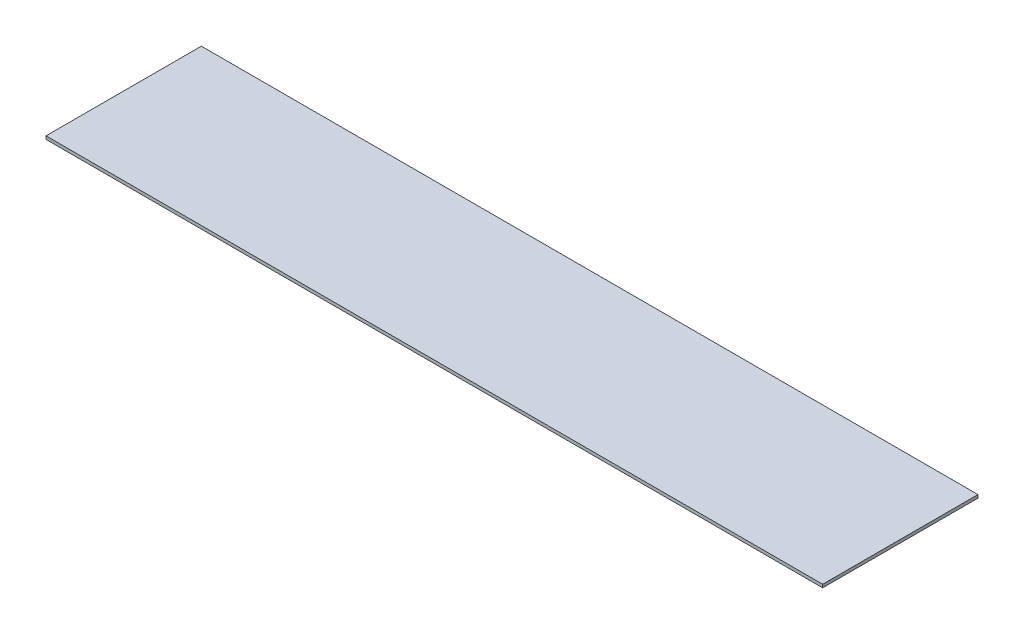
ISO-10303-21;
HEADER;
FILE_DESCRIPTION(('STEP AP214'),'2;1');
FILE_NAME('part.step','',(''),(''),'','','');
FILE_SCHEMA(('AUTOMOTIVE_DESIGN { 1 0 10303 214 1 1 1 1 }'));
ENDSEC;
DATA;
#1=APPLICATION_CONTEXT('core data for automotive mechanical design processes');
#2=APPLICATION_PROTOCOL_DEFINITION('international standard','automotive_design',2000,#1);
#3=PRODUCT_CONTEXT('',#1,'mechanical');
#4=PRODUCT('Part','Part','',(#3));
#5=PRODUCT_RELATED_PRODUCT_CATEGORY('part','',(#4));
#6=PRODUCT_DEFINITION_FORMATION('','',#4);
#7=PRODUCT_DEFINITION_CONTEXT('part definition',#1,'design');
#8=PRODUCT_DEFINITION('design','',#6,#7);
#9=PRODUCT_DEFINITION_SHAPE('','',#8);
#10=(LENGTH_UNIT() NAMED_UNIT(*) SI_UNIT(.MILLI.,.METRE.));
#11=(NAMED_UNIT(*) PLANE_ANGLE_UNIT() SI_UNIT($,.RADIAN.));
#12=(NAMED_UNIT(*) SI_UNIT($,.STERADIAN.) SOLID_ANGLE_UNIT());
#13=UNCERTAINTY_MEASURE_WITH_UNIT(LENGTH_MEASURE(1.E-05),#10,'distance_accuracy_value','');
#14=(GEOMETRIC_REPRESENTATION_CONTEXT(3) GLOBAL_UNCERTAINTY_ASSIGNED_CONTEXT((#13)) GLOBAL_UNIT_ASSIGNED_CONTEXT((#10,
#11,#12)) REPRESENTATION_CONTEXT('',''));
#15=CARTESIAN_POINT('',(0.,0.,0.));
#16=DIRECTION('',(0.,0.,1.));
#17=DIRECTION('',(1.,0.,0.));
#18=AXIS2_PLACEMENT_3D('',#15,#16,#17);
#19=CARTESIAN_POINT('',(25.,0.2,5.));
#20=DIRECTION('',(-1.,0.,0.));
#21=DIRECTION('',(0.,0.,1.));
#22=AXIS2_PLACEMENT_3D('',#19,#20,#21);
#23=PLANE('',#22);
#24=DIRECTION('',(0.,0.,-1.));
#25=VECTOR('',#24,1.);
#26=CARTESIAN_POINT('',(25.,0.,5.));
#27=LINE('',#26,#25);
#28=CARTESIAN_POINT('',(25.,0.,5.));
#29=VERTEX_POINT('',#28);
#30=CARTESIAN_POINT('',(25.,0.,-5.));
#31=VERTEX_POINT('',#30);
#32=EDGE_CURVE('E107',#29,#31,#27,.T.);
#33=ORIENTED_EDGE('',*,*,#32,.T.);
#34=DIRECTION('',(0.,-1.,0.));
#35=VECTOR('',#34,1.);
#36=CARTESIAN_POINT('',(25.,0.2,-5.));
#37=LINE('',#36,#35);
#38=CARTESIAN_POINT('',(25.,0.2,-5.));
#39=VERTEX_POINT('',#38);
#40=EDGE_CURVE('E11',#39,#31,#37,.T.);
#41=ORIENTED_EDGE('',*,*,#40,.F.);
#42=DIRECTION('',(0.,0.,-1.));
#43=VECTOR('',#42,1.);
#44=CARTESIAN_POINT('',(25.,0.2,5.));
#45=LINE('',#44,#43);
#46=CARTESIAN_POINT('',(25.,0.2,5.));
#47=VERTEX_POINT('',#46);
#48=EDGE_CURVE('E91',#47,#39,#45,.T.);
#49=ORIENTED_EDGE('',*,*,#48,.F.);
#50=DIRECTION('',(0.,-1.,0.));
#51=VECTOR('',#50,1.);
#52=CARTESIAN_POINT('',(25.,0.2,5.));
#53=LINE('',#52,#51);
#54=EDGE_CURVE('E103',#47,#29,#53,.T.);
#55=ORIENTED_EDGE('',*,*,#54,.T.);
#56=EDGE_LOOP('',(#33,#41,#49,#55));
#57=FACE_BOUND('',#56,.T.);
#58=ADVANCED_FACE('F39',(#57),#23,.F.);
#59=CARTESIAN_POINT('',(-25.,0.2,-5.));
#60=DIRECTION('',(0.,0.,1.));
#61=DIRECTION('',(1.,0.,0.));
#62=AXIS2_PLACEMENT_3D('',#59,#60,#61);
#63=PLANE('',#62);
#64=DIRECTION('',(-1.,0.,0.));
#65=VECTOR('',#64,1.);
#66=CARTESIAN_POINT('',(-25.,0.,-5.));
#67=LINE('',#66,#65);
#68=CARTESIAN_POINT('',(-25.,0.,-5.));
#69=VERTEX_POINT('',#68);
#70=EDGE_CURVE('E96',#31,#69,#67,.T.);
#71=ORIENTED_EDGE('',*,*,#70,.T.);
#72=DIRECTION('',(0.,-1.,0.));
#73=VECTOR('',#72,1.);
#74=CARTESIAN_POINT('',(-25.,0.2,-5.));
#75=LINE('',#74,#73);
#76=CARTESIAN_POINT('',(-25.,0.2,-5.));
#77=VERTEX_POINT('',#76);
#78=EDGE_CURVE('E48',#77,#69,#75,.T.);
#79=ORIENTED_EDGE('',*,*,#78,.F.);
#80=DIRECTION('',(-1.,0.,0.));
#81=VECTOR('',#80,1.);
#82=CARTESIAN_POINT('',(-25.,0.2,-5.));
#83=LINE('',#82,#81);
#84=EDGE_CURVE('E86',#39,#77,#83,.T.);
#85=ORIENTED_EDGE('',*,*,#84,.F.);
#86=ORIENTED_EDGE('',*,*,#40,.T.);
#87=EDGE_LOOP('',(#71,#79,#85,#86));
#88=FACE_BOUND('',#87,.T.);
#89=ADVANCED_FACE('F95',(#88),#63,.F.);
#90=CARTESIAN_POINT('',(-25.,0.2,5.));
#91=DIRECTION('',(1.,0.,0.));
#92=DIRECTION('',(0.,0.,-1.));
#93=AXIS2_PLACEMENT_3D('',#90,#91,#92);
#94=PLANE('',#93);
#95=DIRECTION('',(0.,0.,1.));
#96=VECTOR('',#95,1.);
#97=CARTESIAN_POINT('',(-25.,0.,5.));
#98=LINE('',#97,#96);
#99=CARTESIAN_POINT('',(-25.,0.,5.));
#100=VERTEX_POINT('',#99);
#101=EDGE_CURVE('E73',#69,#100,#98,.T.);
#102=ORIENTED_EDGE('',*,*,#101,.T.);
#103=DIRECTION('',(0.,-1.,0.));
#104=VECTOR('',#103,1.);
#105=CARTESIAN_POINT('',(-25.,0.2,5.));
#106=LINE('',#105,#104);
#107=CARTESIAN_POINT('',(-25.,0.2,5.));
#108=VERTEX_POINT('',#107);
#109=EDGE_CURVE('E98',#108,#100,#106,.T.);
#110=ORIENTED_EDGE('',*,*,#109,.F.);
#111=DIRECTION('',(0.,0.,1.));
#112=VECTOR('',#111,1.);
#113=CARTESIAN_POINT('',(-25.,0.2,5.));
#114=LINE('',#113,#112);
#115=EDGE_CURVE('E89',#77,#108,#114,.T.);
#116=ORIENTED_EDGE('',*,*,#115,.F.);
#117=ORIENTED_EDGE('',*,*,#78,.T.);
#118=EDGE_LOOP('',(#102,#110,#116,#117));
#119=FACE_BOUND('',#118,.T.);
#120=ADVANCED_FACE('F99',(#119),#94,.F.);
#121=CARTESIAN_POINT('',(-25.,0.2,5.));
#122=DIRECTION('',(0.,0.,-1.));
#123=DIRECTION('',(-1.,0.,0.));
#124=AXIS2_PLACEMENT_3D('',#121,#122,#123);
#125=PLANE('',#124);
#126=DIRECTION('',(1.,0.,0.));
#127=VECTOR('',#126,1.);
#128=CARTESIAN_POINT('',(-25.,0.,5.));
#129=LINE('',#128,#127);
#130=EDGE_CURVE('E79',#100,#29,#129,.T.);
#131=ORIENTED_EDGE('',*,*,#130,.T.);
#132=ORIENTED_EDGE('',*,*,#54,.F.);
#133=DIRECTION('',(1.,0.,0.));
#134=VECTOR('',#133,1.);
#135=CARTESIAN_POINT('',(-25.,0.2,5.));
#136=LINE('',#135,#134);
#137=EDGE_CURVE('E56',#108,#47,#136,.T.);
#138=ORIENTED_EDGE('',*,*,#137,.F.);
#139=ORIENTED_EDGE('',*,*,#109,.T.);
#140=EDGE_LOOP('',(#131,#132,#138,#139));
#141=FACE_BOUND('',#140,.T.);
#142=ADVANCED_FACE('F120',(#141),#125,.F.);
#143=CARTESIAN_POINT('',(0.,0.2,0.));
#144=DIRECTION('',(0.,-1.,0.));
#145=DIRECTION('',(0.,0.,-1.));
#146=AXIS2_PLACEMENT_3D('',#143,#144,#145);
#147=PLANE('',#146);
#148=ORIENTED_EDGE('',*,*,#48,.T.);
#149=ORIENTED_EDGE('',*,*,#84,.T.);
#150=ORIENTED_EDGE('',*,*,#115,.T.);
#151=ORIENTED_EDGE('',*,*,#137,.T.);
#152=EDGE_LOOP('',(#148,#149,#150,#151));
#153=FACE_BOUND('',#152,.T.);
#154=ADVANCED_FACE('F87',(#153),#147,.F.);
#155=CARTESIAN_POINT('',(0.,0.,0.));
#156=DIRECTION('',(0.,-1.,0.));
#157=DIRECTION('',(0.,0.,-1.));
#158=AXIS2_PLACEMENT_3D('',#155,#156,#157);
#159=PLANE('',#158);
#160=ORIENTED_EDGE('',*,*,#32,.F.);
#161=ORIENTED_EDGE('',*,*,#130,.F.);
#162=ORIENTED_EDGE('',*,*,#101,.F.);
#163=ORIENTED_EDGE('',*,*,#70,.F.);
#164=EDGE_LOOP('',(#160,#161,#162,#163));
#165=FACE_BOUND('',#164,.T.);
#166=ADVANCED_FACE('F123',(#165),#159,.T.);
#167=CLOSED_SHELL('',(#58,#89,#120,#142,#154,#166));
#168=MANIFOLD_SOLID_BREP('B2',#167);
#169=ADVANCED_BREP_SHAPE_REPRESENTATION('',(#18,#168),#14);
#170=SHAPE_DEFINITION_REPRESENTATION(#9,#169);
ENDSEC;
END-ISO-10303-21;
